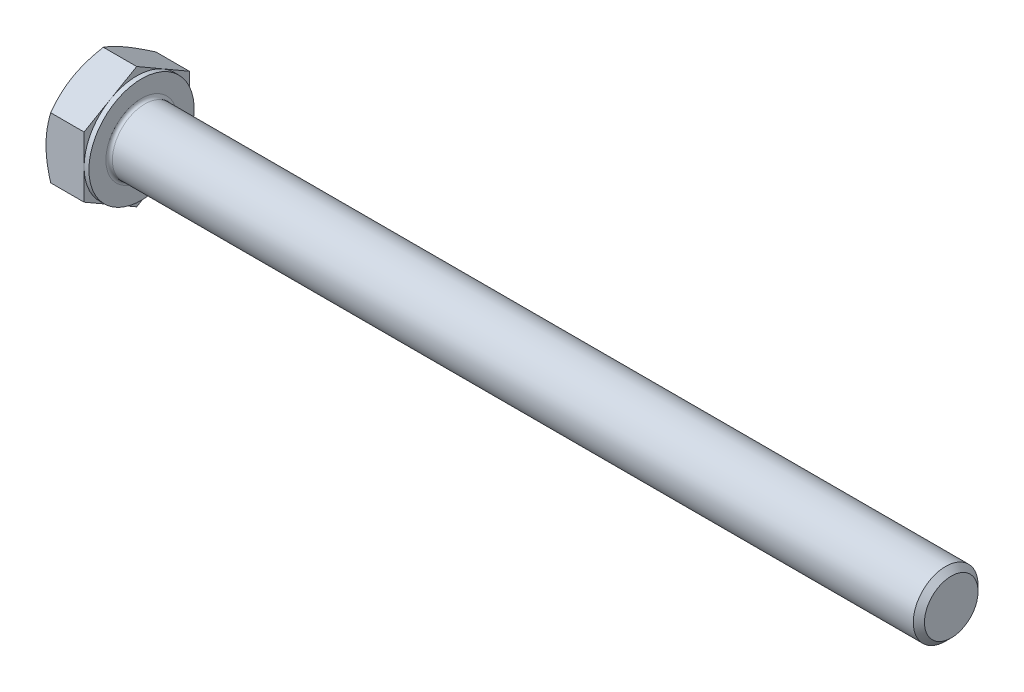
ISO-10303-21;
HEADER;
FILE_DESCRIPTION(('STEP AP214'),'2;1');
FILE_NAME('part.step','',(''),(''),'','','');
FILE_SCHEMA(('AUTOMOTIVE_DESIGN { 1 0 10303 214 1 1 1 1 }'));
ENDSEC;
DATA;
#1=APPLICATION_CONTEXT('core data for automotive mechanical design processes');
#2=APPLICATION_PROTOCOL_DEFINITION('international standard','automotive_design',2000,#1);
#3=PRODUCT_CONTEXT('',#1,'mechanical');
#4=PRODUCT('Part','Part','',(#3));
#5=PRODUCT_RELATED_PRODUCT_CATEGORY('part','',(#4));
#6=PRODUCT_DEFINITION_FORMATION('','',#4);
#7=PRODUCT_DEFINITION_CONTEXT('part definition',#1,'design');
#8=PRODUCT_DEFINITION('design','',#6,#7);
#9=PRODUCT_DEFINITION_SHAPE('','',#8);
#10=(LENGTH_UNIT() NAMED_UNIT(*) SI_UNIT(.MILLI.,.METRE.));
#11=(NAMED_UNIT(*) PLANE_ANGLE_UNIT() SI_UNIT($,.RADIAN.));
#12=(NAMED_UNIT(*) SI_UNIT($,.STERADIAN.) SOLID_ANGLE_UNIT());
#13=UNCERTAINTY_MEASURE_WITH_UNIT(LENGTH_MEASURE(1.E-05),#10,'distance_accuracy_value','');
#14=(GEOMETRIC_REPRESENTATION_CONTEXT(3) GLOBAL_UNCERTAINTY_ASSIGNED_CONTEXT((#13)) GLOBAL_UNIT_ASSIGNED_CONTEXT((#10,
#11,#12)) REPRESENTATION_CONTEXT('',''));
#15=CARTESIAN_POINT('',(0.,0.,0.));
#16=DIRECTION('',(0.,0.,1.));
#17=DIRECTION('',(1.,0.,0.));
#18=AXIS2_PLACEMENT_3D('',#15,#16,#17);
#19=CARTESIAN_POINT('',(0.,7.50555349946514,0.));
#20=DIRECTION('',(1.,0.,0.));
#21=DIRECTION('',(0.,0.,-1.));
#22=AXIS2_PLACEMENT_3D('',#19,#20,#21);
#23=PLANE('',#22);
#24=CARTESIAN_POINT('',(0.,0.,0.));
#25=DIRECTION('',(1.,0.,0.));
#26=DIRECTION('',(0.,0.,-1.));
#27=AXIS2_PLACEMENT_3D('',#24,#25,#26);
#28=CIRCLE('',#27,6.49999999995998);
#29=CARTESIAN_POINT('',(1.15542506612411E-11,-5.62916512458153,-3.24999999999));
#30=VERTEX_POINT('',#29);
#31=CARTESIAN_POINT('',(1.1552457738841E-11,0.,-6.49999999997999));
#32=VERTEX_POINT('',#31);
#33=EDGE_CURVE('E113',#30,#32,#28,.T.);
#34=ORIENTED_EDGE('',*,*,#33,.F.);
#35=CARTESIAN_POINT('',(0.,0.,0.));
#36=DIRECTION('',(1.,0.,0.));
#37=DIRECTION('',(0.,0.,-1.));
#38=AXIS2_PLACEMENT_3D('',#35,#36,#37);
#39=CIRCLE('',#38,6.49999999995998);
#40=CARTESIAN_POINT('',(1.15525952101679E-11,-5.62916512458152,3.24999999999));
#41=VERTEX_POINT('',#40);
#42=EDGE_CURVE('E110',#41,#30,#39,.T.);
#43=ORIENTED_EDGE('',*,*,#42,.F.);
#44=CARTESIAN_POINT('',(0.,0.,0.));
#45=DIRECTION('',(1.,0.,0.));
#46=DIRECTION('',(0.,0.,-1.));
#47=AXIS2_PLACEMENT_3D('',#44,#45,#46);
#48=CIRCLE('',#47,6.49999999995998);
#49=CARTESIAN_POINT('',(1.15513193265597E-11,0.,6.49999999997999));
#50=VERTEX_POINT('',#49);
#51=EDGE_CURVE('E473',#50,#41,#48,.T.);
#52=ORIENTED_EDGE('',*,*,#51,.F.);
#53=CARTESIAN_POINT('',(0.,0.,0.));
#54=DIRECTION('',(1.,0.,0.));
#55=DIRECTION('',(0.,0.,-1.));
#56=AXIS2_PLACEMENT_3D('',#53,#54,#55);
#57=CIRCLE('',#56,6.49999999995998);
#58=CARTESIAN_POINT('',(1.15525370952398E-11,5.62916512458152,3.24999999999));
#59=VERTEX_POINT('',#58);
#60=EDGE_CURVE('E175',#59,#50,#57,.T.);
#61=ORIENTED_EDGE('',*,*,#60,.F.);
#62=CARTESIAN_POINT('',(0.,0.,0.));
#63=DIRECTION('',(1.,0.,0.));
#64=DIRECTION('',(0.,0.,-1.));
#65=AXIS2_PLACEMENT_3D('',#62,#63,#64);
#66=CIRCLE('',#65,6.49999999995998);
#67=CARTESIAN_POINT('',(1.15522847853007E-11,5.62916512458152,-3.24999999999));
#68=VERTEX_POINT('',#67);
#69=EDGE_CURVE('E471',#68,#59,#66,.T.);
#70=ORIENTED_EDGE('',*,*,#69,.F.);
#71=CARTESIAN_POINT('',(0.,0.,0.));
#72=DIRECTION('',(1.,0.,0.));
#73=DIRECTION('',(0.,0.,-1.));
#74=AXIS2_PLACEMENT_3D('',#71,#72,#73);
#75=CIRCLE('',#74,6.49999999995998);
#76=EDGE_CURVE('E116',#32,#68,#75,.T.);
#77=ORIENTED_EDGE('',*,*,#76,.F.);
#78=EDGE_LOOP('',(#34,#43,#52,#61,#70,#77));
#79=FACE_BOUND('',#78,.T.);
#80=ADVANCED_FACE('F16',(#79),#23,.F.);
#81=CARTESIAN_POINT('',(0.584039923126056,0.,0.));
#82=DIRECTION('',(1.,0.,0.));
#83=DIRECTION('',(0.,0.,-1.));
#84=AXIS2_PLACEMENT_3D('',#81,#82,#83);
#85=CONICAL_SURFACE('',#84,7.51158682049891,1.047197551212);
#86=ORIENTED_EDGE('',*,*,#42,.T.);
#87=CARTESIAN_POINT('',(2.38320372118128E-11,-5.62916512459777,-3.24999999999938));
#88=CARTESIAN_POINT('',(-2.65652344175662E-05,-5.70880728473447,-3.11205573221969));
#89=CARTESIAN_POINT('',(0.00337972763251614,-5.78844560823788,-2.97411810968284));
#90=CARTESIAN_POINT('',(0.0168605830573982,-5.94756588426562,-2.69851370708889));
#91=CARTESIAN_POINT('',(0.0269338255085051,-6.02704786462283,-2.56084687882384));
#92=CARTESIAN_POINT('',(0.0534848017009931,-6.18534206384372,-2.28667328322969));
#93=CARTESIAN_POINT('',(0.0699302938009765,-6.26415564509097,-2.15016415618305));
#94=CARTESIAN_POINT('',(0.108872020464246,-6.42140731241995,-1.87779627879436));
#95=CARTESIAN_POINT('',(0.131368414291866,-6.4998453885628,-1.74193754566698));
#96=CARTESIAN_POINT('',(0.207238975555896,-6.73427122699287,-1.33590008289914));
#97=CARTESIAN_POINT('',(0.269031363386545,-6.88957797343577,-1.06690090730184));
#98=CARTESIAN_POINT('',(0.411540414604498,-7.19885589650209,-0.531215830891612));
#99=CARTESIAN_POINT('',(0.492351589092369,-7.35281628523265,-0.264548615257223));
#100=CARTESIAN_POINT('',(0.580556583603041,-7.50555349946482,-5.6849116452278E-13));
#101=B_SPLINE_CURVE_WITH_KNOTS('',3,(#87,#88,#89,#90,#91,#92,#93,#94,#95,#96,#97,#98,#99,#100),
.UNSPECIFIED.,.F.,.F.,(4,2,2,2,2,2,4),(0.,0.47780419504982,0.955513809519796,1.43083727329602,
1.90617324917161,2.85559935540238,3.80984701130895),.UNSPECIFIED.);
#102=CARTESIAN_POINT('',(0.580556583603041,-7.50555349946482,0.));
#103=VERTEX_POINT('',#102);
#104=EDGE_CURVE('E128',#30,#103,#101,.T.);
#105=ORIENTED_EDGE('',*,*,#104,.T.);
#106=CARTESIAN_POINT('',(0.580556583603041,-7.50555349946482,5.68331081558561E-13));
#107=CARTESIAN_POINT('',(0.492351589092376,-7.35281628523265,0.26454861525721));
#108=CARTESIAN_POINT('',(0.411540414604506,-7.19885589650209,0.53121583089159));
#109=CARTESIAN_POINT('',(0.269031363386549,-6.88957797343579,1.06690090730181));
#110=CARTESIAN_POINT('',(0.207238975555898,-6.7342712269929,1.33590008289911));
#111=CARTESIAN_POINT('',(0.131368414291874,-6.49984538856282,1.74193754566694));
#112=CARTESIAN_POINT('',(0.108872020464258,-6.42140731241997,1.8777962787943));
#113=CARTESIAN_POINT('',(0.0699302938009773,-6.26415564509101,2.15016415618299));
#114=CARTESIAN_POINT('',(0.0534848017009799,-6.18534206384378,2.28667328322963));
#115=CARTESIAN_POINT('',(0.0269338255085281,-6.02704786462284,2.56084687882373));
#116=CARTESIAN_POINT('',(0.0168605830574717,-5.94756588426557,2.69851370708872));
#117=CARTESIAN_POINT('',(0.00337972763244828,-5.78844560823805,2.97411810968276));
#118=CARTESIAN_POINT('',(-2.65652346774198E-05,-5.70880728473494,3.11205573221976));
#119=CARTESIAN_POINT('',(2.31055659989855E-11,-5.62916512459895,3.24999999999983));
#120=B_SPLINE_CURVE_WITH_KNOTS('',3,(#106,#107,#108,#109,#110,#111,#112,#113,#114,#115,#116,
#117,#118,#119),.UNSPECIFIED.,.F.,.F.,(4,2,2,2,2,2,4),(0.,0.954247655906536,1.9036737621373,
2.37900973801286,2.85433320178906,3.332042816259,3.80984701130876),.UNSPECIFIED.);
#121=EDGE_CURVE('E134',#103,#41,#120,.T.);
#122=ORIENTED_EDGE('',*,*,#121,.T.);
#123=EDGE_LOOP('',(#86,#105,#122));
#124=FACE_BOUND('',#123,.T.);
#125=ADVANCED_FACE('F132',(#124),#85,.T.);
#126=CARTESIAN_POINT('',(0.584039923126056,0.,0.));
#127=DIRECTION('',(1.,0.,0.));
#128=DIRECTION('',(0.,0.,-1.));
#129=AXIS2_PLACEMENT_3D('',#126,#127,#128);
#130=CONICAL_SURFACE('',#129,7.51158682049891,1.047197551212);
#131=ORIENTED_EDGE('',*,*,#33,.T.);
#132=CARTESIAN_POINT('',(2.38274285891329E-11,0.,-6.49999999999875));
#133=CARTESIAN_POINT('',(-2.65652344212664E-05,-0.159284320272008,-6.49999999999955));
#134=CARTESIAN_POINT('',(0.00337972763251264,-0.318560967278251,-6.49999999999988));
#135=CARTESIAN_POINT('',(0.0168605830573947,-0.636801519333316,-6.50000000000012));
#136=CARTESIAN_POINT('',(0.0269338255085013,-0.795765480047881,-6.50000000000003));
#137=CARTESIAN_POINT('',(0.0534848017009893,-1.11235387848978,-6.49999999999997));
#138=CARTESIAN_POINT('',(0.069930293800973,-1.26998104098423,-6.49999999999999));
#139=CARTESIAN_POINT('',(0.108872020464243,-1.58448437564218,-6.50000000000001));
#140=CARTESIAN_POINT('',(0.131368414291863,-1.74136052792788,-6.50000000000001));
#141=CARTESIAN_POINT('',(0.207238975555892,-2.21021220478805,-6.5));
#142=CARTESIAN_POINT('',(0.269031363386541,-2.52082569767383,-6.5));
#143=CARTESIAN_POINT('',(0.411540414604496,-3.13938154380645,-6.50000000000001));
#144=CARTESIAN_POINT('',(0.492351589092367,-3.44730232126758,-6.50000000000001));
#145=CARTESIAN_POINT('',(0.580556583603039,-3.75277674973192,-6.5));
#146=B_SPLINE_CURVE_WITH_KNOTS('',3,(#132,#133,#134,#135,#136,#137,#138,#139,#140,#141,#142,
#143,#144,#145),.UNSPECIFIED.,.F.,.F.,(4,2,2,2,2,2,4),(0.,0.477804195049821,0.955513809519797,
1.43083727329602,1.90617324917161,2.85559935540238,3.80984701130895),.UNSPECIFIED.);
#147=CARTESIAN_POINT('',(0.580556583603039,-3.75277674973241,-6.49999999999972));
#148=VERTEX_POINT('',#147);
#149=EDGE_CURVE('E124',#32,#148,#146,.T.);
#150=ORIENTED_EDGE('',*,*,#149,.T.);
#151=CARTESIAN_POINT('',(0.580556583603038,-3.7527767497329,-6.49999999999943));
#152=CARTESIAN_POINT('',(0.492351589092373,-3.90551396396507,-6.23545138474279));
#153=CARTESIAN_POINT('',(0.411540414604504,-4.05947435269562,-5.96878416910841));
#154=CARTESIAN_POINT('',(0.269031363386549,-4.36875227576193,-5.4330990926982));
#155=CARTESIAN_POINT('',(0.207238975555899,-4.52405902220482,-5.1640999171009));
#156=CARTESIAN_POINT('',(0.131368414291876,-4.75848486063489,-4.75806245433307));
#157=CARTESIAN_POINT('',(0.10887202046426,-4.83692293677774,-4.62220372120571));
#158=CARTESIAN_POINT('',(0.06993029380098,-4.9941746041067,-4.34983584381702));
#159=CARTESIAN_POINT('',(0.0534848017009829,-5.07298818535392,-4.21332671677038));
#160=CARTESIAN_POINT('',(0.0269338255085313,-5.23128238457486,-3.93915312117628));
#161=CARTESIAN_POINT('',(0.0168605830574747,-5.31076436493214,-3.80148629291129));
#162=CARTESIAN_POINT('',(0.00337972763245123,-5.46988464095965,-3.52588189031725));
#163=CARTESIAN_POINT('',(-2.65652346743515E-05,-5.54952296446276,-3.38794426778026));
#164=CARTESIAN_POINT('',(2.31092524797815E-11,-5.62916512459875,-3.25000000000019));
#165=B_SPLINE_CURVE_WITH_KNOTS('',3,(#151,#152,#153,#154,#155,#156,#157,#158,#159,#160,#161,
#162,#163,#164),.UNSPECIFIED.,.F.,.F.,(4,2,2,2,2,2,4),(0.,0.954247655906532,1.90367376213729,
2.37900973801285,2.85433320178905,3.33204281625898,3.80984701130874),.UNSPECIFIED.);
#166=EDGE_CURVE('E122',#148,#30,#165,.T.);
#167=ORIENTED_EDGE('',*,*,#166,.T.);
#168=EDGE_LOOP('',(#131,#150,#167));
#169=FACE_BOUND('',#168,.T.);
#170=ADVANCED_FACE('F123',(#169),#130,.T.);
#171=CARTESIAN_POINT('',(0.584039923126056,0.,0.));
#172=DIRECTION('',(1.,0.,0.));
#173=DIRECTION('',(0.,0.,-1.));
#174=AXIS2_PLACEMENT_3D('',#171,#172,#173);
#175=CONICAL_SURFACE('',#174,7.51158682049891,1.047197551212);
#176=CARTESIAN_POINT('',(0.580556583603034,3.75277674973191,-6.5));
#177=CARTESIAN_POINT('',(0.49235158909237,3.44730232126758,-6.5));
#178=CARTESIAN_POINT('',(0.4115404146045,3.13938154380646,-6.5));
#179=CARTESIAN_POINT('',(0.269031363386546,2.52082569767386,-6.5));
#180=CARTESIAN_POINT('',(0.207238975555895,2.21021220478808,-6.5));
#181=CARTESIAN_POINT('',(0.131368414291872,1.74136052792792,-6.5));
#182=CARTESIAN_POINT('',(0.108872020464256,1.58448437564224,-6.5));
#183=CARTESIAN_POINT('',(0.069930293800976,1.26998104098431,-6.5));
#184=CARTESIAN_POINT('',(0.0534848017009786,1.11235387848986,-6.5));
#185=CARTESIAN_POINT('',(0.0269338255085272,0.795765480047986,-6.5));
#186=CARTESIAN_POINT('',(0.016860583057471,0.636801519333434,-6.5));
#187=CARTESIAN_POINT('',(0.00337972763244784,0.318560967278407,-6.5));
#188=CARTESIAN_POINT('',(-2.6565234677822E-05,0.159284320272187,-6.5));
#189=CARTESIAN_POINT('',(2.3104915477682E-11,2.07644777694978E-13,-6.5));
#190=B_SPLINE_CURVE_WITH_KNOTS('',3,(#176,#177,#178,#179,#180,#181,#182,#183,#184,#185,#186,
#187,#188,#189),.UNSPECIFIED.,.F.,.F.,(4,2,2,2,2,2,4),(0.,0.954247655906533,1.90367376213729,
2.37900973801285,2.85433320178905,3.33204281625898,3.80984701130875),.UNSPECIFIED.);
#191=CARTESIAN_POINT('',(0.580556583603034,3.7527767497324,-6.49999999999972));
#192=VERTEX_POINT('',#191);
#193=EDGE_CURVE('E142',#192,#32,#190,.T.);
#194=ORIENTED_EDGE('',*,*,#193,.T.);
#195=ORIENTED_EDGE('',*,*,#76,.T.);
#196=CARTESIAN_POINT('',(2.38261934329666E-11,5.62916512459776,-3.24999999999938));
#197=CARTESIAN_POINT('',(-2.65652344227733E-05,5.54952296446245,-3.38794426777988));
#198=CARTESIAN_POINT('',(0.00337972763251139,5.46988464095962,-3.52588189031705));
#199=CARTESIAN_POINT('',(0.016860583057394,5.31076436493229,-3.80148629291124));
#200=CARTESIAN_POINT('',(0.0269338255085008,5.23128238457494,-3.9391531211762));
#201=CARTESIAN_POINT('',(0.0534848017009884,5.07298818535393,-4.21332671677028));
#202=CARTESIAN_POINT('',(0.0699302938009713,4.99417460410672,-4.34983584381695));
#203=CARTESIAN_POINT('',(0.108872020464241,4.83692293677777,-4.62220372120566));
#204=CARTESIAN_POINT('',(0.131368414291861,4.75848486063491,-4.75806245433303));
#205=CARTESIAN_POINT('',(0.207238975555891,4.52405902220482,-5.16409991710086));
#206=CARTESIAN_POINT('',(0.26903136338654,4.36875227576193,-5.43309909269816));
#207=CARTESIAN_POINT('',(0.411540414604492,4.05947435269563,-5.96878416910839));
#208=CARTESIAN_POINT('',(0.492351589092362,3.90551396396507,-6.23545138474278));
#209=CARTESIAN_POINT('',(0.580556583603034,3.75277674973289,-6.49999999999943));
#210=B_SPLINE_CURVE_WITH_KNOTS('',3,(#196,#197,#198,#199,#200,#201,#202,#203,#204,#205,#206,
#207,#208,#209),.UNSPECIFIED.,.F.,.F.,(4,2,2,2,2,2,4),(0.,0.477804195049818,0.955513809519791,
1.43083727329602,1.9061732491716,2.85559935540237,3.80984701130894),.UNSPECIFIED.);
#211=EDGE_CURVE('E258',#68,#192,#210,.T.);
#212=ORIENTED_EDGE('',*,*,#211,.T.);
#213=EDGE_LOOP('',(#194,#195,#212));
#214=FACE_BOUND('',#213,.T.);
#215=ADVANCED_FACE('F247',(#214),#175,.T.);
#216=CARTESIAN_POINT('',(0.584039923126056,0.,0.));
#217=DIRECTION('',(1.,0.,0.));
#218=DIRECTION('',(0.,0.,-1.));
#219=AXIS2_PLACEMENT_3D('',#216,#217,#218);
#220=CONICAL_SURFACE('',#219,7.51158682049891,1.047197551212);
#221=CARTESIAN_POINT('',(0.580556583603039,7.50555349946481,-5.68730723337055E-13));
#222=CARTESIAN_POINT('',(0.492351589092373,7.35281628523265,-0.26454861525721));
#223=CARTESIAN_POINT('',(0.411540414604503,7.19885589650209,-0.531215830891591));
#224=CARTESIAN_POINT('',(0.269031363386547,6.88957797343578,-1.06690090730181));
#225=CARTESIAN_POINT('',(0.207238975555896,6.7342712269929,-1.33590008289911));
#226=CARTESIAN_POINT('',(0.131368414291872,6.49984538856282,-1.74193754566694));
#227=CARTESIAN_POINT('',(0.108872020464257,6.42140731241997,-1.8777962787943));
#228=CARTESIAN_POINT('',(0.0699302938009763,6.26415564509101,-2.15016415618299));
#229=CARTESIAN_POINT('',(0.0534848017009786,6.18534206384378,-2.28667328322963));
#230=CARTESIAN_POINT('',(0.0269338255085268,6.02704786462284,-2.56084687882373));
#231=CARTESIAN_POINT('',(0.0168605830574704,5.94756588426557,-2.69851370708872));
#232=CARTESIAN_POINT('',(0.00337972763244712,5.78844560823805,-2.97411810968276));
#233=CARTESIAN_POINT('',(-2.65652346784502E-05,5.70880728473494,-3.11205573221975));
#234=CARTESIAN_POINT('',(2.31045695706013E-11,5.62916512459895,-3.24999999999983));
#235=B_SPLINE_CURVE_WITH_KNOTS('',3,(#221,#222,#223,#224,#225,#226,#227,#228,#229,#230,#231,
#232,#233,#234),.UNSPECIFIED.,.F.,.F.,(4,2,2,2,2,2,4),(0.,0.954247655906536,1.9036737621373,
2.37900973801286,2.85433320178906,3.332042816259,3.80984701130876),.UNSPECIFIED.);
#236=CARTESIAN_POINT('',(0.580556583603039,7.50555349946481,0.));
#237=VERTEX_POINT('',#236);
#238=EDGE_CURVE('E252',#237,#68,#235,.T.);
#239=ORIENTED_EDGE('',*,*,#238,.T.);
#240=ORIENTED_EDGE('',*,*,#69,.T.);
#241=CARTESIAN_POINT('',(2.38261091987206E-11,5.62916512459777,3.24999999999938));
#242=CARTESIAN_POINT('',(-2.65652344223339E-05,5.70880728473446,3.11205573221969));
#243=CARTESIAN_POINT('',(0.00337972763251168,5.78844560823787,2.97411810968284));
#244=CARTESIAN_POINT('',(0.0168605830573938,5.94756588426561,2.69851370708889));
#245=CARTESIAN_POINT('',(0.0269338255085003,6.02704786462282,2.56084687882384));
#246=CARTESIAN_POINT('',(0.0534848017009883,6.18534206384371,2.28667328322969));
#247=CARTESIAN_POINT('',(0.0699302938009719,6.26415564509096,2.15016415618305));
#248=CARTESIAN_POINT('',(0.108872020464242,6.42140731241995,1.87779627879436));
#249=CARTESIAN_POINT('',(0.131368414291862,6.49984538856279,1.74193754566698));
#250=CARTESIAN_POINT('',(0.207238975555892,6.73427122699287,1.33590008289914));
#251=CARTESIAN_POINT('',(0.269031363386541,6.88957797343576,1.06690090730184));
#252=CARTESIAN_POINT('',(0.411540414604495,7.19885589650208,0.531215830891611));
#253=CARTESIAN_POINT('',(0.492351589092366,7.35281628523265,0.264548615257222));
#254=CARTESIAN_POINT('',(0.580556583603038,7.50555349946481,5.68017948575027E-13));
#255=B_SPLINE_CURVE_WITH_KNOTS('',3,(#241,#242,#243,#244,#245,#246,#247,#248,#249,#250,#251,
#252,#253,#254),.UNSPECIFIED.,.F.,.F.,(4,2,2,2,2,2,4),(0.,0.477804195049821,0.955513809519796,
1.43083727329602,1.90617324917161,2.85559935540238,3.80984701130895),.UNSPECIFIED.);
#256=EDGE_CURVE('E238',#59,#237,#255,.T.);
#257=ORIENTED_EDGE('',*,*,#256,.T.);
#258=EDGE_LOOP('',(#239,#240,#257));
#259=FACE_BOUND('',#258,.T.);
#260=ADVANCED_FACE('F244',(#259),#220,.T.);
#261=CARTESIAN_POINT('',(0.584039923126056,0.,0.));
#262=DIRECTION('',(1.,0.,0.));
#263=DIRECTION('',(0.,0.,-1.));
#264=AXIS2_PLACEMENT_3D('',#261,#262,#263);
#265=CONICAL_SURFACE('',#264,7.51158682049891,1.047197551212);
#266=ORIENTED_EDGE('',*,*,#51,.T.);
#267=CARTESIAN_POINT('',(2.38275060121851E-11,-5.62916512459777,3.24999999999938));
#268=CARTESIAN_POINT('',(-2.65652344211646E-05,-5.54952296446246,3.38794426777988));
#269=CARTESIAN_POINT('',(0.00337972763251294,-5.46988464095962,3.52588189031706));
#270=CARTESIAN_POINT('',(0.0168605830573952,-5.3107643649323,3.80148629291124));
#271=CARTESIAN_POINT('',(0.0269338255085019,-5.23128238457494,3.93915312117621));
#272=CARTESIAN_POINT('',(0.0534848017009894,-5.07298818535393,4.21332671677028));
#273=CARTESIAN_POINT('',(0.0699302938009724,-4.99417460410673,4.34983584381695));
#274=CARTESIAN_POINT('',(0.108872020464242,-4.83692293677777,4.62220372120566));
#275=CARTESIAN_POINT('',(0.131368414291862,-4.75848486063491,4.75806245433303));
#276=CARTESIAN_POINT('',(0.207238975555891,-4.52405902220482,5.16409991710086));
#277=CARTESIAN_POINT('',(0.26903136338654,-4.36875227576193,5.43309909269816));
#278=CARTESIAN_POINT('',(0.411540414604493,-4.05947435269563,5.96878416910839));
#279=CARTESIAN_POINT('',(0.492351589092363,-3.90551396396507,6.23545138474278));
#280=CARTESIAN_POINT('',(0.580556583603034,-3.75277674973289,6.49999999999943));
#281=B_SPLINE_CURVE_WITH_KNOTS('',3,(#267,#268,#269,#270,#271,#272,#273,#274,#275,#276,#277,
#278,#279,#280),.UNSPECIFIED.,.F.,.F.,(4,2,2,2,2,2,4),(0.,0.477804195049819,0.955513809519792,
1.43083727329602,1.9061732491716,2.85559935540237,3.80984701130893),.UNSPECIFIED.);
#282=CARTESIAN_POINT('',(0.580556583603129,-3.75277674973273,6.49999999999971));
#283=VERTEX_POINT('',#282);
#284=EDGE_CURVE('E129',#41,#283,#281,.T.);
#285=ORIENTED_EDGE('',*,*,#284,.T.);
#286=CARTESIAN_POINT('',(0.580556583603034,-3.75277674973191,6.5));
#287=CARTESIAN_POINT('',(0.492351589092369,-3.44730232126758,6.5));
#288=CARTESIAN_POINT('',(0.411540414604499,-3.13938154380647,6.5));
#289=CARTESIAN_POINT('',(0.269031363386544,-2.52082569767386,6.5));
#290=CARTESIAN_POINT('',(0.207238975555893,-2.21021220478808,6.5));
#291=CARTESIAN_POINT('',(0.13136841429187,-1.74136052792793,6.5));
#292=CARTESIAN_POINT('',(0.108872020464254,-1.58448437564224,6.5));
#293=CARTESIAN_POINT('',(0.0699302938009738,-1.26998104098431,6.5));
#294=CARTESIAN_POINT('',(0.0534848017009764,-1.11235387848986,6.5));
#295=CARTESIAN_POINT('',(0.026933825508525,-0.795765480047986,6.5));
#296=CARTESIAN_POINT('',(0.0168605830574687,-0.636801519333433,6.5));
#297=CARTESIAN_POINT('',(0.00337972763244557,-0.318560967278406,6.5));
#298=CARTESIAN_POINT('',(-2.65652346800939E-05,-0.159284320272186,6.5));
#299=CARTESIAN_POINT('',(2.31026386531193E-11,-2.06641493637523E-13,6.5));
#300=B_SPLINE_CURVE_WITH_KNOTS('',3,(#286,#287,#288,#289,#290,#291,#292,#293,#294,#295,#296,
#297,#298,#299),.UNSPECIFIED.,.F.,.F.,(4,2,2,2,2,2,4),(0.,0.954247655906534,1.90367376213729,
2.37900973801285,2.85433320178905,3.33204281625899,3.80984701130875),.UNSPECIFIED.);
#301=EDGE_CURVE('E215',#283,#50,#300,.T.);
#302=ORIENTED_EDGE('',*,*,#301,.T.);
#303=EDGE_LOOP('',(#266,#285,#302));
#304=FACE_BOUND('',#303,.T.);
#305=ADVANCED_FACE('F191',(#304),#265,.T.);
#306=CARTESIAN_POINT('',(0.584039923126056,0.,0.));
#307=DIRECTION('',(1.,0.,0.));
#308=DIRECTION('',(0.,0.,-1.));
#309=AXIS2_PLACEMENT_3D('',#306,#307,#308);
#310=CONICAL_SURFACE('',#309,7.51158682049891,1.047197551212);
#311=CARTESIAN_POINT('',(0.580556583603034,3.75277674973289,6.49999999999943));
#312=CARTESIAN_POINT('',(0.492351589092369,3.90551396396506,6.23545138474279));
#313=CARTESIAN_POINT('',(0.4115404146045,4.05947435269561,5.96878416910841));
#314=CARTESIAN_POINT('',(0.269031363386545,4.36875227576192,5.4330990926982));
#315=CARTESIAN_POINT('',(0.207238975555894,4.52405902220481,5.1640999171009));
#316=CARTESIAN_POINT('',(0.131368414291871,4.75848486063489,4.75806245433307));
#317=CARTESIAN_POINT('',(0.108872020464255,4.83692293677773,4.62220372120571));
#318=CARTESIAN_POINT('',(0.0699302938009758,4.99417460410669,4.34983584381702));
#319=CARTESIAN_POINT('',(0.0534848017009785,5.07298818535391,4.21332671677038));
#320=CARTESIAN_POINT('',(0.0269338255085268,5.23128238457485,3.93915312117628));
#321=CARTESIAN_POINT('',(0.0168605830574702,5.31076436493213,3.80148629291129));
#322=CARTESIAN_POINT('',(0.00337972763244669,5.46988464095964,3.52588189031725));
#323=CARTESIAN_POINT('',(-2.65652346790189E-05,5.54952296446275,3.38794426778026));
#324=CARTESIAN_POINT('',(2.31041565107436E-11,5.62916512459874,3.25000000000019));
#325=B_SPLINE_CURVE_WITH_KNOTS('',3,(#311,#312,#313,#314,#315,#316,#317,#318,#319,#320,#321,
#322,#323,#324),.UNSPECIFIED.,.F.,.F.,(4,2,2,2,2,2,4),(0.,0.954247655906533,1.90367376213729,
2.37900973801285,2.85433320178905,3.33204281625898,3.80984701130874),.UNSPECIFIED.);
#326=CARTESIAN_POINT('',(0.580556583603034,3.7527767497324,6.49999999999971));
#327=VERTEX_POINT('',#326);
#328=EDGE_CURVE('E197',#327,#59,#325,.T.);
#329=ORIENTED_EDGE('',*,*,#328,.T.);
#330=ORIENTED_EDGE('',*,*,#60,.T.);
#331=CARTESIAN_POINT('',(2.38242332515276E-11,0.,6.49999999999875));
#332=CARTESIAN_POINT('',(-2.65652344247335E-05,0.159284320272008,6.49999999999955));
#333=CARTESIAN_POINT('',(0.00337972763250945,0.318560967278251,6.49999999999988));
#334=CARTESIAN_POINT('',(0.0168605830573921,0.636801519333313,6.50000000000012));
#335=CARTESIAN_POINT('',(0.0269338255084991,0.795765480047878,6.50000000000003));
#336=CARTESIAN_POINT('',(0.0534848017009868,1.11235387848978,6.49999999999997));
#337=CARTESIAN_POINT('',(0.0699302938009699,1.26998104098423,6.49999999999999));
#338=CARTESIAN_POINT('',(0.10887202046424,1.58448437564217,6.50000000000001));
#339=CARTESIAN_POINT('',(0.131368414291859,1.74136052792787,6.5));
#340=CARTESIAN_POINT('',(0.207238975555889,2.21021220478804,6.49999999999999));
#341=CARTESIAN_POINT('',(0.269031363386538,2.52082569767382,6.49999999999999));
#342=CARTESIAN_POINT('',(0.411540414604491,3.13938154380644,6.5));
#343=CARTESIAN_POINT('',(0.492351589092362,3.44730232126757,6.5));
#344=CARTESIAN_POINT('',(0.580556583603033,3.75277674973191,6.5));
#345=B_SPLINE_CURVE_WITH_KNOTS('',3,(#331,#332,#333,#334,#335,#336,#337,#338,#339,#340,#341,
#342,#343,#344),.UNSPECIFIED.,.F.,.F.,(4,2,2,2,2,2,4),(0.,0.477804195049819,0.955513809519793,
1.43083727329602,1.90617324917161,2.85559935540237,3.80984701130894),.UNSPECIFIED.);
#346=EDGE_CURVE('E206',#50,#327,#345,.T.);
#347=ORIENTED_EDGE('',*,*,#346,.T.);
#348=EDGE_LOOP('',(#329,#330,#347));
#349=FACE_BOUND('',#348,.T.);
#350=ADVANCED_FACE('F186',(#349),#310,.T.);
#351=CARTESIAN_POINT('',(5.3,-7.50555349946514,0.));
#352=DIRECTION('',(0.,0.866025403784438,-0.500000000000001));
#353=DIRECTION('',(0.,0.500000000000001,0.866025403784438));
#354=AXIS2_PLACEMENT_3D('',#351,#352,#353);
#355=PLANE('',#354);
#356=DIRECTION('',(-1.,0.,0.));
#357=VECTOR('',#356,1.);
#358=CARTESIAN_POINT('',(5.3,-3.75277674973257,6.5));
#359=LINE('',#358,#357);
#360=CARTESIAN_POINT('',(4.7,-3.75277674973257,6.5));
#361=VERTEX_POINT('',#360);
#362=EDGE_CURVE('E397',#361,#283,#359,.T.);
#363=ORIENTED_EDGE('',*,*,#362,.T.);
#364=ORIENTED_EDGE('',*,*,#284,.F.);
#365=ORIENTED_EDGE('',*,*,#121,.F.);
#366=DIRECTION('',(1.,0.,0.));
#367=VECTOR('',#366,1.);
#368=CARTESIAN_POINT('',(5.3,-7.50555349946514,0.));
#369=LINE('',#368,#367);
#370=CARTESIAN_POINT('',(4.7,-7.50555349946514,0.));
#371=VERTEX_POINT('',#370);
#372=EDGE_CURVE('E140',#103,#371,#369,.T.);
#373=ORIENTED_EDGE('',*,*,#372,.T.);
#374=DIRECTION('',(0.,-0.500000000000002,-0.866025403784438));
#375=VECTOR('',#374,1.);
#376=CARTESIAN_POINT('',(4.7,-5.62916512459885,3.25000000000001));
#377=LINE('',#376,#375);
#378=CARTESIAN_POINT('',(4.7,-5.62916512459885,3.25000000000001));
#379=VERTEX_POINT('',#378);
#380=EDGE_CURVE('E377',#379,#371,#377,.T.);
#381=ORIENTED_EDGE('',*,*,#380,.F.);
#382=DIRECTION('',(0.,-0.5,-0.866025403784438));
#383=VECTOR('',#382,1.);
#384=CARTESIAN_POINT('',(4.7,-3.75277674973257,6.5));
#385=LINE('',#384,#383);
#386=EDGE_CURVE('E382',#361,#379,#385,.T.);
#387=ORIENTED_EDGE('',*,*,#386,.F.);
#388=EDGE_LOOP('',(#363,#364,#365,#373,#381,#387));
#389=FACE_BOUND('',#388,.T.);
#390=ADVANCED_FACE('F182',(#389),#355,.F.);
#391=CARTESIAN_POINT('',(5.3,-3.75277674973258,-6.5));
#392=DIRECTION('',(0.,0.866025403784439,0.5));
#393=DIRECTION('',(0.,-0.5,0.866025403784439));
#394=AXIS2_PLACEMENT_3D('',#391,#392,#393);
#395=PLANE('',#394);
#396=ORIENTED_EDGE('',*,*,#372,.F.);
#397=ORIENTED_EDGE('',*,*,#104,.F.);
#398=ORIENTED_EDGE('',*,*,#166,.F.);
#399=DIRECTION('',(1.,0.,0.));
#400=VECTOR('',#399,1.);
#401=CARTESIAN_POINT('',(5.3,-3.75277674973258,-6.5));
#402=LINE('',#401,#400);
#403=CARTESIAN_POINT('',(4.7,-3.75277674973258,-6.5));
#404=VERTEX_POINT('',#403);
#405=EDGE_CURVE('E259',#148,#404,#402,.T.);
#406=ORIENTED_EDGE('',*,*,#405,.T.);
#407=DIRECTION('',(0.,0.499999999999998,-0.866025403784439));
#408=VECTOR('',#407,1.);
#409=CARTESIAN_POINT('',(4.7,-5.62916512459885,-3.25));
#410=LINE('',#409,#408);
#411=CARTESIAN_POINT('',(4.7,-5.62916512459885,-3.25));
#412=VERTEX_POINT('',#411);
#413=EDGE_CURVE('E367',#412,#404,#410,.T.);
#414=ORIENTED_EDGE('',*,*,#413,.F.);
#415=DIRECTION('',(0.,0.500000000000002,-0.866025403784438));
#416=VECTOR('',#415,1.);
#417=CARTESIAN_POINT('',(4.7,-7.50555349946514,0.));
#418=LINE('',#417,#416);
#419=EDGE_CURVE('E372',#371,#412,#418,.T.);
#420=ORIENTED_EDGE('',*,*,#419,.F.);
#421=EDGE_LOOP('',(#396,#397,#398,#406,#414,#420));
#422=FACE_BOUND('',#421,.T.);
#423=ADVANCED_FACE('F138',(#422),#395,.F.);
#424=CARTESIAN_POINT('',(5.3,3.75277674973256,-6.5));
#425=DIRECTION('',(0.,0.,1.));
#426=DIRECTION('',(0.,-1.,0.));
#427=AXIS2_PLACEMENT_3D('',#424,#425,#426);
#428=PLANE('',#427);
#429=ORIENTED_EDGE('',*,*,#405,.F.);
#430=ORIENTED_EDGE('',*,*,#149,.F.);
#431=ORIENTED_EDGE('',*,*,#193,.F.);
#432=DIRECTION('',(1.,0.,0.));
#433=VECTOR('',#432,1.);
#434=CARTESIAN_POINT('',(5.3,3.75277674973256,-6.5));
#435=LINE('',#434,#433);
#436=CARTESIAN_POINT('',(4.7,3.75277674973256,-6.5));
#437=VERTEX_POINT('',#436);
#438=EDGE_CURVE('E405',#192,#437,#435,.T.);
#439=ORIENTED_EDGE('',*,*,#438,.T.);
#440=DIRECTION('',(0.,1.,0.));
#441=VECTOR('',#440,1.);
#442=CARTESIAN_POINT('',(4.7,6.5,-6.5));
#443=LINE('',#442,#441);
#444=CARTESIAN_POINT('',(4.7,0.,-6.5));
#445=VERTEX_POINT('',#444);
#446=EDGE_CURVE('E352',#445,#437,#443,.T.);
#447=ORIENTED_EDGE('',*,*,#446,.F.);
#448=DIRECTION('',(0.,1.,0.));
#449=VECTOR('',#448,1.);
#450=CARTESIAN_POINT('',(4.7,6.5,-6.5));
#451=LINE('',#450,#449);
#452=EDGE_CURVE('E362',#404,#445,#451,.T.);
#453=ORIENTED_EDGE('',*,*,#452,.F.);
#454=EDGE_LOOP('',(#429,#430,#431,#439,#447,#453));
#455=FACE_BOUND('',#454,.T.);
#456=ADVANCED_FACE('F268',(#455),#428,.F.);
#457=CARTESIAN_POINT('',(5.3,3.75277674973256,-6.5));
#458=DIRECTION('',(0.,-0.866025403784438,0.500000000000001));
#459=DIRECTION('',(0.,-0.500000000000001,-0.866025403784438));
#460=AXIS2_PLACEMENT_3D('',#457,#458,#459);
#461=PLANE('',#460);
#462=ORIENTED_EDGE('',*,*,#438,.F.);
#463=ORIENTED_EDGE('',*,*,#211,.F.);
#464=ORIENTED_EDGE('',*,*,#238,.F.);
#465=DIRECTION('',(1.,0.,0.));
#466=VECTOR('',#465,1.);
#467=CARTESIAN_POINT('',(5.3,7.50555349946514,0.));
#468=LINE('',#467,#466);
#469=CARTESIAN_POINT('',(4.7,7.50555349946514,0.));
#470=VERTEX_POINT('',#469);
#471=EDGE_CURVE('E243',#237,#470,#468,.T.);
#472=ORIENTED_EDGE('',*,*,#471,.T.);
#473=DIRECTION('',(0.,0.500000000000001,0.866025403784438));
#474=VECTOR('',#473,1.);
#475=CARTESIAN_POINT('',(4.7,5.62916512459885,-3.25000000000001));
#476=LINE('',#475,#474);
#477=CARTESIAN_POINT('',(4.7,5.62916512459885,-3.25000000000001));
#478=VERTEX_POINT('',#477);
#479=EDGE_CURVE('E347',#478,#470,#476,.T.);
#480=ORIENTED_EDGE('',*,*,#479,.F.);
#481=DIRECTION('',(0.,0.500000000000001,0.866025403784438));
#482=VECTOR('',#481,1.);
#483=CARTESIAN_POINT('',(4.7,3.75277674973256,-6.5));
#484=LINE('',#483,#482);
#485=EDGE_CURVE('E357',#437,#478,#484,.T.);
#486=ORIENTED_EDGE('',*,*,#485,.F.);
#487=EDGE_LOOP('',(#462,#463,#464,#472,#480,#486));
#488=FACE_BOUND('',#487,.T.);
#489=ADVANCED_FACE('F234',(#488),#461,.F.);
#490=CARTESIAN_POINT('',(5.3,7.50555349946514,0.));
#491=DIRECTION('',(0.,-0.866025403784438,-0.500000000000001));
#492=DIRECTION('',(0.,0.500000000000001,-0.866025403784438));
#493=AXIS2_PLACEMENT_3D('',#490,#491,#492);
#494=PLANE('',#493);
#495=ORIENTED_EDGE('',*,*,#471,.F.);
#496=ORIENTED_EDGE('',*,*,#256,.F.);
#497=ORIENTED_EDGE('',*,*,#328,.F.);
#498=DIRECTION('',(-1.,0.,0.));
#499=VECTOR('',#498,1.);
#500=CARTESIAN_POINT('',(5.3,3.75277674973257,6.5));
#501=LINE('',#500,#499);
#502=CARTESIAN_POINT('',(4.7,3.75277674973257,6.5));
#503=VERTEX_POINT('',#502);
#504=EDGE_CURVE('E214',#327,#503,#501,.F.);
#505=ORIENTED_EDGE('',*,*,#504,.T.);
#506=DIRECTION('',(0.,-0.500000000000001,0.866025403784438));
#507=VECTOR('',#506,1.);
#508=CARTESIAN_POINT('',(4.7,5.62916512459885,3.25000000000001));
#509=LINE('',#508,#507);
#510=CARTESIAN_POINT('',(4.7,5.62916512459885,3.25));
#511=VERTEX_POINT('',#510);
#512=EDGE_CURVE('E337',#511,#503,#509,.T.);
#513=ORIENTED_EDGE('',*,*,#512,.F.);
#514=DIRECTION('',(0.,-0.500000000000001,0.866025403784438));
#515=VECTOR('',#514,1.);
#516=CARTESIAN_POINT('',(4.7,7.50555349946514,0.));
#517=LINE('',#516,#515);
#518=EDGE_CURVE('E342',#470,#511,#517,.T.);
#519=ORIENTED_EDGE('',*,*,#518,.F.);
#520=EDGE_LOOP('',(#495,#496,#497,#505,#513,#519));
#521=FACE_BOUND('',#520,.T.);
#522=ADVANCED_FACE('F227',(#521),#494,.F.);
#523=CARTESIAN_POINT('',(5.3,3.75277674973257,6.5));
#524=DIRECTION('',(0.,0.,-1.));
#525=DIRECTION('',(-1.,0.,0.));
#526=AXIS2_PLACEMENT_3D('',#523,#524,#525);
#527=PLANE('',#526);
#528=ORIENTED_EDGE('',*,*,#504,.F.);
#529=ORIENTED_EDGE('',*,*,#346,.F.);
#530=ORIENTED_EDGE('',*,*,#301,.F.);
#531=ORIENTED_EDGE('',*,*,#362,.F.);
#532=DIRECTION('',(0.,1.,0.));
#533=VECTOR('',#532,1.);
#534=CARTESIAN_POINT('',(4.7,6.5,6.5));
#535=LINE('',#534,#533);
#536=CARTESIAN_POINT('',(4.7,0.,6.5));
#537=VERTEX_POINT('',#536);
#538=EDGE_CURVE('E387',#537,#361,#535,.F.);
#539=ORIENTED_EDGE('',*,*,#538,.F.);
#540=DIRECTION('',(0.,1.,0.));
#541=VECTOR('',#540,1.);
#542=CARTESIAN_POINT('',(4.7,6.5,6.5));
#543=LINE('',#542,#541);
#544=EDGE_CURVE('E329',#503,#537,#543,.F.);
#545=ORIENTED_EDGE('',*,*,#544,.F.);
#546=EDGE_LOOP('',(#528,#529,#530,#531,#539,#545));
#547=FACE_BOUND('',#546,.T.);
#548=ADVANCED_FACE('F222',(#547),#527,.F.);
#549=CARTESIAN_POINT('',(4.7,6.5,0.));
#550=DIRECTION('',(1.,0.,0.));
#551=DIRECTION('',(0.,0.,-1.));
#552=AXIS2_PLACEMENT_3D('',#549,#550,#551);
#553=PLANE('',#552);
#554=ORIENTED_EDGE('',*,*,#386,.T.);
#555=CARTESIAN_POINT('',(4.7,0.,0.));
#556=DIRECTION('',(-1.,0.,0.));
#557=DIRECTION('',(0.,0.,1.));
#558=AXIS2_PLACEMENT_3D('',#555,#556,#557);
#559=CIRCLE('',#558,6.5);
#560=EDGE_CURVE('E216',#537,#379,#559,.F.);
#561=ORIENTED_EDGE('',*,*,#560,.F.);
#562=ORIENTED_EDGE('',*,*,#538,.T.);
#563=EDGE_LOOP('',(#554,#561,#562));
#564=FACE_BOUND('',#563,.T.);
#565=ADVANCED_FACE('F226',(#564),#553,.T.);
#566=CARTESIAN_POINT('',(4.7,6.5,0.));
#567=DIRECTION('',(1.,0.,0.));
#568=DIRECTION('',(0.,0.,-1.));
#569=AXIS2_PLACEMENT_3D('',#566,#567,#568);
#570=PLANE('',#569);
#571=ORIENTED_EDGE('',*,*,#419,.T.);
#572=CARTESIAN_POINT('',(4.7,0.,0.));
#573=DIRECTION('',(-1.,0.,0.));
#574=DIRECTION('',(0.,0.,1.));
#575=AXIS2_PLACEMENT_3D('',#572,#573,#574);
#576=CIRCLE('',#575,6.5);
#577=EDGE_CURVE('E431',#379,#412,#576,.F.);
#578=ORIENTED_EDGE('',*,*,#577,.F.);
#579=ORIENTED_EDGE('',*,*,#380,.T.);
#580=EDGE_LOOP('',(#571,#578,#579));
#581=FACE_BOUND('',#580,.T.);
#582=ADVANCED_FACE('F451',(#581),#570,.T.);
#583=CARTESIAN_POINT('',(4.7,6.5,0.));
#584=DIRECTION('',(1.,0.,0.));
#585=DIRECTION('',(0.,0.,-1.));
#586=AXIS2_PLACEMENT_3D('',#583,#584,#585);
#587=PLANE('',#586);
#588=ORIENTED_EDGE('',*,*,#452,.T.);
#589=CARTESIAN_POINT('',(4.7,0.,0.));
#590=DIRECTION('',(-1.,0.,0.));
#591=DIRECTION('',(0.,0.,1.));
#592=AXIS2_PLACEMENT_3D('',#589,#590,#591);
#593=CIRCLE('',#592,6.5);
#594=EDGE_CURVE('E429',#412,#445,#593,.F.);
#595=ORIENTED_EDGE('',*,*,#594,.F.);
#596=ORIENTED_EDGE('',*,*,#413,.T.);
#597=EDGE_LOOP('',(#588,#595,#596));
#598=FACE_BOUND('',#597,.T.);
#599=ADVANCED_FACE('F454',(#598),#587,.T.);
#600=CARTESIAN_POINT('',(4.7,6.5,0.));
#601=DIRECTION('',(1.,0.,0.));
#602=DIRECTION('',(0.,0.,-1.));
#603=AXIS2_PLACEMENT_3D('',#600,#601,#602);
#604=PLANE('',#603);
#605=CARTESIAN_POINT('',(4.7,0.,0.));
#606=DIRECTION('',(-1.,0.,0.));
#607=DIRECTION('',(0.,0.,1.));
#608=AXIS2_PLACEMENT_3D('',#605,#606,#607);
#609=CIRCLE('',#608,6.5);
#610=EDGE_CURVE('E426',#445,#478,#609,.F.);
#611=ORIENTED_EDGE('',*,*,#610,.F.);
#612=ORIENTED_EDGE('',*,*,#446,.T.);
#613=ORIENTED_EDGE('',*,*,#485,.T.);
#614=EDGE_LOOP('',(#611,#612,#613));
#615=FACE_BOUND('',#614,.T.);
#616=ADVANCED_FACE('F458',(#615),#604,.T.);
#617=CARTESIAN_POINT('',(4.7,6.5,0.));
#618=DIRECTION('',(1.,0.,0.));
#619=DIRECTION('',(0.,0.,-1.));
#620=AXIS2_PLACEMENT_3D('',#617,#618,#619);
#621=PLANE('',#620);
#622=ORIENTED_EDGE('',*,*,#518,.T.);
#623=CARTESIAN_POINT('',(4.7,0.,0.));
#624=DIRECTION('',(-1.,0.,0.));
#625=DIRECTION('',(0.,0.,1.));
#626=AXIS2_PLACEMENT_3D('',#623,#624,#625);
#627=CIRCLE('',#626,6.5);
#628=EDGE_CURVE('E423',#478,#511,#627,.F.);
#629=ORIENTED_EDGE('',*,*,#628,.F.);
#630=ORIENTED_EDGE('',*,*,#479,.T.);
#631=EDGE_LOOP('',(#622,#629,#630));
#632=FACE_BOUND('',#631,.T.);
#633=ADVANCED_FACE('F463',(#632),#621,.T.);
#634=CARTESIAN_POINT('',(4.7,6.5,0.));
#635=DIRECTION('',(1.,0.,0.));
#636=DIRECTION('',(0.,0.,-1.));
#637=AXIS2_PLACEMENT_3D('',#634,#635,#636);
#638=PLANE('',#637);
#639=ORIENTED_EDGE('',*,*,#544,.T.);
#640=CARTESIAN_POINT('',(4.7,0.,0.));
#641=DIRECTION('',(-1.,0.,0.));
#642=DIRECTION('',(0.,0.,1.));
#643=AXIS2_PLACEMENT_3D('',#640,#641,#642);
#644=CIRCLE('',#643,6.5);
#645=EDGE_CURVE('E420',#511,#537,#644,.F.);
#646=ORIENTED_EDGE('',*,*,#645,.F.);
#647=ORIENTED_EDGE('',*,*,#512,.T.);
#648=EDGE_LOOP('',(#639,#646,#647));
#649=FACE_BOUND('',#648,.T.);
#650=ADVANCED_FACE('F444',(#649),#638,.T.);
#651=CARTESIAN_POINT('',(0.,0.,0.));
#652=DIRECTION('',(-1.,0.,0.));
#653=DIRECTION('',(0.,0.,1.));
#654=AXIS2_PLACEMENT_3D('',#651,#652,#653);
#655=CYLINDRICAL_SURFACE('',#654,6.5);
#656=ORIENTED_EDGE('',*,*,#594,.T.);
#657=ORIENTED_EDGE('',*,*,#610,.T.);
#658=ORIENTED_EDGE('',*,*,#628,.T.);
#659=ORIENTED_EDGE('',*,*,#645,.T.);
#660=ORIENTED_EDGE('',*,*,#560,.T.);
#661=ORIENTED_EDGE('',*,*,#577,.T.);
#662=EDGE_LOOP('',(#656,#657,#658,#659,#660,#661));
#663=FACE_BOUND('',#662,.T.);
#664=CARTESIAN_POINT('',(5.3,0.,0.));
#665=DIRECTION('',(-1.,0.,0.));
#666=DIRECTION('',(0.,0.,1.));
#667=AXIS2_PLACEMENT_3D('',#664,#665,#666);
#668=CIRCLE('',#667,6.5);
#669=CARTESIAN_POINT('',(5.3,0.,6.5));
#670=VERTEX_POINT('',#669);
#671=EDGE_CURVE('E417',#670,#670,#668,.F.);
#672=ORIENTED_EDGE('',*,*,#671,.F.);
#673=EDGE_LOOP('',(#672));
#674=FACE_BOUND('',#673,.T.);
#675=ADVANCED_FACE('F437',(#663,#674),#655,.T.);
#676=CARTESIAN_POINT('',(105.3,0.,0.));
#677=DIRECTION('',(-1.,0.,0.));
#678=DIRECTION('',(0.,0.,1.));
#679=AXIS2_PLACEMENT_3D('',#676,#677,#678);
#680=PLANE('',#679);
#681=CARTESIAN_POINT('',(105.299999999943,0.,0.));
#682=DIRECTION('',(-1.,0.,0.));
#683=DIRECTION('',(0.,0.,1.));
#684=AXIS2_PLACEMENT_3D('',#681,#682,#683);
#685=CIRCLE('',#684,3.3095000000003);
#686=CARTESIAN_POINT('',(105.299999999943,0.,3.3095000000003));
#687=VERTEX_POINT('',#686);
#688=EDGE_CURVE('E414',#687,#687,#685,.T.);
#689=ORIENTED_EDGE('',*,*,#688,.F.);
#690=EDGE_LOOP('',(#689));
#691=FACE_BOUND('',#690,.T.);
#692=ADVANCED_FACE('F313',(#691),#680,.F.);
#693=CARTESIAN_POINT('',(5.3,7.50555349946514,0.));
#694=DIRECTION('',(1.,0.,0.));
#695=DIRECTION('',(0.,0.,-1.));
#696=AXIS2_PLACEMENT_3D('',#693,#694,#695);
#697=PLANE('',#696);
#698=ORIENTED_EDGE('',*,*,#671,.T.);
#699=EDGE_LOOP('',(#698));
#700=FACE_BOUND('',#699,.T.);
#701=CARTESIAN_POINT('',(5.3,0.,0.));
#702=DIRECTION('',(1.,0.,0.));
#703=DIRECTION('',(0.,0.,1.));
#704=AXIS2_PLACEMENT_3D('',#701,#702,#703);
#705=CIRCLE('',#704,4.4);
#706=CARTESIAN_POINT('',(5.3,0.,-4.4));
#707=VERTEX_POINT('',#706);
#708=CARTESIAN_POINT('',(5.3,0.,4.4));
#709=VERTEX_POINT('',#708);
#710=EDGE_CURVE('E300',#707,#709,#705,.F.);
#711=ORIENTED_EDGE('',*,*,#710,.T.);
#712=CARTESIAN_POINT('',(5.3,0.,0.));
#713=DIRECTION('',(1.,0.,0.));
#714=DIRECTION('',(0.,0.,-1.));
#715=AXIS2_PLACEMENT_3D('',#712,#713,#714);
#716=CIRCLE('',#715,4.4);
#717=EDGE_CURVE('E35',#709,#707,#716,.F.);
#718=ORIENTED_EDGE('',*,*,#717,.T.);
#719=EDGE_LOOP('',(#711,#718));
#720=FACE_BOUND('',#719,.T.);
#721=ADVANCED_FACE('F304',(#700,#720),#697,.T.);
#722=CARTESIAN_POINT('',(104.609499999981,0.,0.));
#723=DIRECTION('',(-1.,0.,0.));
#724=DIRECTION('',(0.,0.,1.));
#725=AXIS2_PLACEMENT_3D('',#722,#723,#724);
#726=CONICAL_SURFACE('',#725,4.0000000000191,0.785398163438609);
#727=CARTESIAN_POINT('',(104.6095,0.,0.));
#728=DIRECTION('',(-1.,0.,0.));
#729=DIRECTION('',(0.,0.,1.));
#730=AXIS2_PLACEMENT_3D('',#727,#728,#729);
#731=CIRCLE('',#730,4.);
#732=CARTESIAN_POINT('',(104.6095,0.,4.));
#733=VERTEX_POINT('',#732);
#734=EDGE_CURVE('E27',#733,#733,#731,.T.);
#735=ORIENTED_EDGE('',*,*,#734,.F.);
#736=EDGE_LOOP('',(#735));
#737=FACE_BOUND('',#736,.T.);
#738=ORIENTED_EDGE('',*,*,#688,.T.);
#739=EDGE_LOOP('',(#738));
#740=FACE_BOUND('',#739,.T.);
#741=ADVANCED_FACE('F287',(#737,#740),#726,.T.);
#742=CARTESIAN_POINT('',(5.7,0.,0.));
#743=DIRECTION('',(1.,0.,0.));
#744=DIRECTION('',(0.,0.,-1.));
#745=AXIS2_PLACEMENT_3D('',#742,#743,#744);
#746=TOROIDAL_SURFACE('',#745,4.4,0.4);
#747=CARTESIAN_POINT('',(5.7,0.,0.));
#748=DIRECTION('',(-1.,0.,0.));
#749=DIRECTION('',(0.,0.,1.));
#750=AXIS2_PLACEMENT_3D('',#747,#748,#749);
#751=CIRCLE('',#750,4.);
#752=CARTESIAN_POINT('',(5.7,0.,4.));
#753=VERTEX_POINT('',#752);
#754=EDGE_CURVE('E11',#753,#753,#751,.F.);
#755=ORIENTED_EDGE('',*,*,#754,.F.);
#756=EDGE_LOOP('',(#755));
#757=FACE_BOUND('',#756,.T.);
#758=ORIENTED_EDGE('',*,*,#710,.F.);
#759=ORIENTED_EDGE('',*,*,#717,.F.);
#760=EDGE_LOOP('',(#758,#759));
#761=FACE_BOUND('',#760,.T.);
#762=ADVANCED_FACE('F281',(#757,#761),#746,.F.);
#763=CARTESIAN_POINT('',(0.,0.,0.));
#764=DIRECTION('',(-1.,0.,0.));
#765=DIRECTION('',(0.,0.,1.));
#766=AXIS2_PLACEMENT_3D('',#763,#764,#765);
#767=CYLINDRICAL_SURFACE('',#766,4.);
#768=ORIENTED_EDGE('',*,*,#754,.T.);
#769=EDGE_LOOP('',(#768));
#770=FACE_BOUND('',#769,.T.);
#771=ORIENTED_EDGE('',*,*,#734,.T.);
#772=EDGE_LOOP('',(#771));
#773=FACE_BOUND('',#772,.T.);
#774=ADVANCED_FACE('F279',(#770,#773),#767,.T.);
#775=CLOSED_SHELL('',(#80,#125,#170,#215,#260,#305,#350,#390,#423,#456,#489,#522,#548,#565,#582,
#599,#616,#633,#650,#675,#692,#721,#741,#762,#774));
#776=MANIFOLD_SOLID_BREP('B1',#775);
#777=ADVANCED_BREP_SHAPE_REPRESENTATION('',(#18,#776),#14);
#778=SHAPE_DEFINITION_REPRESENTATION(#9,#777);
ENDSEC;
END-ISO-10303-21;
